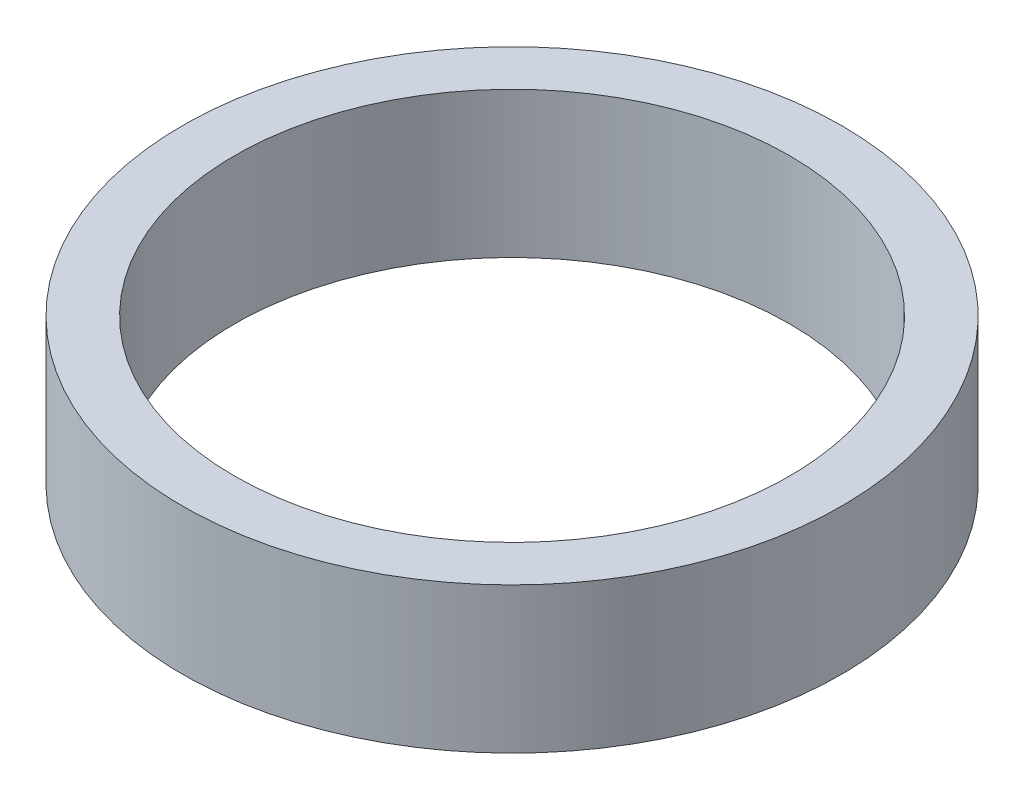
ISO-10303-21;
HEADER;
FILE_DESCRIPTION(('STEP AP214'),'2;1');
FILE_NAME('part.step','',(''),(''),'','','');
FILE_SCHEMA(('AUTOMOTIVE_DESIGN { 1 0 10303 214 1 1 1 1 }'));
ENDSEC;
DATA;
#1=APPLICATION_CONTEXT('core data for automotive mechanical design processes');
#2=APPLICATION_PROTOCOL_DEFINITION('international standard','automotive_design',2000,#1);
#3=PRODUCT_CONTEXT('',#1,'mechanical');
#4=PRODUCT('Part','Part','',(#3));
#5=PRODUCT_RELATED_PRODUCT_CATEGORY('part','',(#4));
#6=PRODUCT_DEFINITION_FORMATION('','',#4);
#7=PRODUCT_DEFINITION_CONTEXT('part definition',#1,'design');
#8=PRODUCT_DEFINITION('design','',#6,#7);
#9=PRODUCT_DEFINITION_SHAPE('','',#8);
#10=(LENGTH_UNIT() NAMED_UNIT(*) SI_UNIT(.MILLI.,.METRE.));
#11=(NAMED_UNIT(*) PLANE_ANGLE_UNIT() SI_UNIT($,.RADIAN.));
#12=(NAMED_UNIT(*) SI_UNIT($,.STERADIAN.) SOLID_ANGLE_UNIT());
#13=UNCERTAINTY_MEASURE_WITH_UNIT(LENGTH_MEASURE(1.E-05),#10,'distance_accuracy_value','');
#14=(GEOMETRIC_REPRESENTATION_CONTEXT(3) GLOBAL_UNCERTAINTY_ASSIGNED_CONTEXT((#13)) GLOBAL_UNIT_ASSIGNED_CONTEXT((#10,
#11,#12)) REPRESENTATION_CONTEXT('',''));
#15=CARTESIAN_POINT('',(0.,0.,0.));
#16=DIRECTION('',(0.,0.,1.));
#17=DIRECTION('',(1.,0.,0.));
#18=AXIS2_PLACEMENT_3D('',#15,#16,#17);
#19=CARTESIAN_POINT('',(0.,21.,0.));
#20=DIRECTION('',(0.,-1.,0.));
#21=DIRECTION('',(0.,0.,-1.));
#22=AXIS2_PLACEMENT_3D('',#19,#20,#21);
#23=CYLINDRICAL_SURFACE('',#22,47.5);
#24=CARTESIAN_POINT('',(0.,21.,0.));
#25=DIRECTION('',(0.,1.,0.));
#26=DIRECTION('',(0.,0.,1.));
#27=AXIS2_PLACEMENT_3D('',#24,#25,#26);
#28=CIRCLE('',#27,47.5);
#29=CARTESIAN_POINT('',(0.,21.,-47.5));
#30=VERTEX_POINT('',#29);
#31=EDGE_CURVE('E10',#30,#30,#28,.T.);
#32=CARTESIAN_POINT('',(0.,0.,0.));
#33=DIRECTION('',(0.,1.,0.));
#34=DIRECTION('',(0.,0.,1.));
#35=AXIS2_PLACEMENT_3D('',#32,#33,#34);
#36=CIRCLE('',#35,47.5);
#37=CARTESIAN_POINT('',(0.,0.,-47.5));
#38=VERTEX_POINT('',#37);
#39=EDGE_CURVE('E37',#38,#38,#36,.T.);
#40=CARTESIAN_POINT('',(0.,21.,-47.5));
#41=CARTESIAN_POINT('',(0.,20.78125,-47.5));
#42=CARTESIAN_POINT('',(0.,20.5625,-47.5));
#43=CARTESIAN_POINT('',(0.,20.125,-47.5));
#44=CARTESIAN_POINT('',(0.,19.90625,-47.5));
#45=CARTESIAN_POINT('',(0.,19.46875,-47.5));
#46=CARTESIAN_POINT('',(0.,19.25,-47.5));
#47=CARTESIAN_POINT('',(0.,18.8125,-47.5));
#48=CARTESIAN_POINT('',(0.,18.59375,-47.5));
#49=CARTESIAN_POINT('',(0.,18.15625,-47.5));
#50=CARTESIAN_POINT('',(0.,17.9375,-47.5));
#51=CARTESIAN_POINT('',(0.,17.5,-47.5));
#52=CARTESIAN_POINT('',(0.,17.28125,-47.5));
#53=CARTESIAN_POINT('',(0.,16.84375,-47.5));
#54=CARTESIAN_POINT('',(0.,16.625,-47.5));
#55=CARTESIAN_POINT('',(0.,16.1875,-47.5));
#56=CARTESIAN_POINT('',(0.,15.96875,-47.5));
#57=CARTESIAN_POINT('',(0.,15.53125,-47.5));
#58=CARTESIAN_POINT('',(0.,15.3125,-47.5));
#59=CARTESIAN_POINT('',(0.,14.875,-47.5));
#60=CARTESIAN_POINT('',(0.,14.65625,-47.5));
#61=CARTESIAN_POINT('',(0.,14.21875,-47.5));
#62=CARTESIAN_POINT('',(0.,14.,-47.5));
#63=CARTESIAN_POINT('',(0.,13.5625,-47.5));
#64=CARTESIAN_POINT('',(0.,13.34375,-47.5));
#65=CARTESIAN_POINT('',(0.,12.90625,-47.5));
#66=CARTESIAN_POINT('',(0.,12.6875,-47.5));
#67=CARTESIAN_POINT('',(0.,12.25,-47.5));
#68=CARTESIAN_POINT('',(0.,12.03125,-47.5));
#69=CARTESIAN_POINT('',(0.,11.59375,-47.5));
#70=CARTESIAN_POINT('',(0.,11.375,-47.5));
#71=CARTESIAN_POINT('',(0.,10.9375,-47.5));
#72=CARTESIAN_POINT('',(0.,10.71875,-47.5));
#73=CARTESIAN_POINT('',(0.,10.28125,-47.5));
#74=CARTESIAN_POINT('',(0.,10.0625,-47.5));
#75=CARTESIAN_POINT('',(0.,9.625,-47.5));
#76=CARTESIAN_POINT('',(0.,9.40625,-47.5));
#77=CARTESIAN_POINT('',(0.,8.96875,-47.5));
#78=CARTESIAN_POINT('',(0.,8.75,-47.5));
#79=CARTESIAN_POINT('',(0.,8.3125,-47.5));
#80=CARTESIAN_POINT('',(0.,8.09375,-47.5));
#81=CARTESIAN_POINT('',(0.,7.65625,-47.5));
#82=CARTESIAN_POINT('',(0.,7.4375,-47.5));
#83=CARTESIAN_POINT('',(0.,7.,-47.5));
#84=CARTESIAN_POINT('',(0.,6.78125,-47.5));
#85=CARTESIAN_POINT('',(0.,6.34375,-47.5));
#86=CARTESIAN_POINT('',(0.,6.125,-47.5));
#87=CARTESIAN_POINT('',(0.,5.6875,-47.5));
#88=CARTESIAN_POINT('',(0.,5.46875,-47.5));
#89=CARTESIAN_POINT('',(0.,5.03125,-47.5));
#90=CARTESIAN_POINT('',(0.,4.8125,-47.5));
#91=CARTESIAN_POINT('',(0.,4.375,-47.5));
#92=CARTESIAN_POINT('',(0.,4.15625,-47.5));
#93=CARTESIAN_POINT('',(0.,3.71875,-47.5));
#94=CARTESIAN_POINT('',(0.,3.5,-47.5));
#95=CARTESIAN_POINT('',(0.,3.0625,-47.5));
#96=CARTESIAN_POINT('',(0.,2.84375,-47.5));
#97=CARTESIAN_POINT('',(0.,2.40625,-47.5));
#98=CARTESIAN_POINT('',(0.,2.1875,-47.5));
#99=CARTESIAN_POINT('',(0.,1.75,-47.5));
#100=CARTESIAN_POINT('',(0.,1.53125,-47.5));
#101=CARTESIAN_POINT('',(0.,1.09375,-47.5));
#102=CARTESIAN_POINT('',(0.,0.875000000000001,-47.5));
#103=CARTESIAN_POINT('',(0.,0.4375,-47.5));
#104=CARTESIAN_POINT('',(0.,0.21875,-47.5));
#105=CARTESIAN_POINT('',(0.,0.,-47.5));
#106=B_SPLINE_CURVE_WITH_KNOTS('',3,(#40,#41,#42,#43,#44,#45,#46,#47,#48,#49,#50,#51,#52,#53,
#54,#55,#56,#57,#58,#59,#60,#61,#62,#63,#64,#65,#66,#67,#68,#69,#70,#71,#72,#73,#74,#75,#76,#77,
#78,#79,#80,#81,#82,#83,#84,#85,#86,#87,#88,#89,#90,#91,#92,#93,#94,#95,#96,#97,#98,#99,#100,
#101,#102,#103,#104,#105),.UNSPECIFIED.,.F.,.F.,(4,2,2,2,2,2,2,2,2,2,2,2,2,2,2,2,2,2,2,2,2,2,2,
2,2,2,2,2,2,2,2,2,4),(0.,0.656249999999997,1.3125,1.96875,2.625,3.28125,3.9375,4.59375,5.25,
5.90625,6.5625,7.21875,7.875,8.53125,9.1875,9.84375,10.5,11.15625,11.8125,12.46875,13.125,
13.78125,14.4375,15.09375,15.75,16.40625,17.0625,17.71875,18.375,19.03125,19.6875,20.34375,21.),.UNSPECIFIED.);
#107=EDGE_CURVE('BSEAM40',#30,#38,#106,.T.);
#108=ORIENTED_EDGE('',*,*,#31,.F.);
#109=ORIENTED_EDGE('',*,*,#39,.T.);
#110=ORIENTED_EDGE('',*,*,#107,.T.);
#111=ORIENTED_EDGE('',*,*,#107,.F.);
#112=EDGE_LOOP('',(#108,#110,#109,#111));
#113=FACE_BOUND('',#112,.T.);
#114=ADVANCED_FACE('F40',(#113),#23,.T.);
#115=CARTESIAN_POINT('',(0.,21.,0.));
#116=DIRECTION('',(0.,1.,0.));
#117=DIRECTION('',(0.,0.,1.));
#118=AXIS2_PLACEMENT_3D('',#115,#116,#117);
#119=PLANE('',#118);
#120=CARTESIAN_POINT('',(0.,21.,0.));
#121=DIRECTION('',(0.,1.,0.));
#122=DIRECTION('',(0.,0.,1.));
#123=AXIS2_PLACEMENT_3D('',#120,#121,#122);
#124=CIRCLE('',#123,40.);
#125=CARTESIAN_POINT('',(0.,21.,-40.));
#126=VERTEX_POINT('',#125);
#127=EDGE_CURVE('E50',#126,#126,#124,.T.);
#128=ORIENTED_EDGE('',*,*,#127,.F.);
#129=EDGE_LOOP('',(#128));
#130=FACE_BOUND('',#129,.T.);
#131=ORIENTED_EDGE('',*,*,#31,.T.);
#132=EDGE_LOOP('',(#131));
#133=FACE_BOUND('',#132,.T.);
#134=ADVANCED_FACE('F59',(#130,#133),#119,.T.);
#135=CARTESIAN_POINT('',(0.,0.,0.));
#136=DIRECTION('',(0.,1.,0.));
#137=DIRECTION('',(0.,0.,1.));
#138=AXIS2_PLACEMENT_3D('',#135,#136,#137);
#139=PLANE('',#138);
#140=CARTESIAN_POINT('',(0.,0.,0.));
#141=DIRECTION('',(0.,1.,0.));
#142=DIRECTION('',(0.,0.,1.));
#143=AXIS2_PLACEMENT_3D('',#140,#141,#142);
#144=CIRCLE('',#143,40.);
#145=CARTESIAN_POINT('',(0.,0.,-40.));
#146=VERTEX_POINT('',#145);
#147=EDGE_CURVE('E47',#146,#146,#144,.T.);
#148=ORIENTED_EDGE('',*,*,#147,.T.);
#149=EDGE_LOOP('',(#148));
#150=FACE_BOUND('',#149,.T.);
#151=ORIENTED_EDGE('',*,*,#39,.F.);
#152=EDGE_LOOP('',(#151));
#153=FACE_BOUND('',#152,.T.);
#154=ADVANCED_FACE('F58',(#150,#153),#139,.F.);
#155=CARTESIAN_POINT('',(0.,21.,0.));
#156=DIRECTION('',(0.,-1.,0.));
#157=DIRECTION('',(0.,0.,-1.));
#158=AXIS2_PLACEMENT_3D('',#155,#156,#157);
#159=CYLINDRICAL_SURFACE('',#158,40.);
#160=CARTESIAN_POINT('',(0.,21.,-40.));
#161=CARTESIAN_POINT('',(0.,20.78125,-40.));
#162=CARTESIAN_POINT('',(0.,20.5625,-40.));
#163=CARTESIAN_POINT('',(0.,20.125,-40.));
#164=CARTESIAN_POINT('',(0.,19.90625,-40.));
#165=CARTESIAN_POINT('',(0.,19.46875,-40.));
#166=CARTESIAN_POINT('',(0.,19.25,-40.));
#167=CARTESIAN_POINT('',(0.,18.8125,-40.));
#168=CARTESIAN_POINT('',(0.,18.59375,-40.));
#169=CARTESIAN_POINT('',(0.,18.15625,-40.));
#170=CARTESIAN_POINT('',(0.,17.9375,-40.));
#171=CARTESIAN_POINT('',(0.,17.5,-40.));
#172=CARTESIAN_POINT('',(0.,17.28125,-40.));
#173=CARTESIAN_POINT('',(0.,16.84375,-40.));
#174=CARTESIAN_POINT('',(0.,16.625,-40.));
#175=CARTESIAN_POINT('',(0.,16.1875,-40.));
#176=CARTESIAN_POINT('',(0.,15.96875,-40.));
#177=CARTESIAN_POINT('',(0.,15.53125,-40.));
#178=CARTESIAN_POINT('',(0.,15.3125,-40.));
#179=CARTESIAN_POINT('',(0.,14.875,-40.));
#180=CARTESIAN_POINT('',(0.,14.65625,-40.));
#181=CARTESIAN_POINT('',(0.,14.21875,-40.));
#182=CARTESIAN_POINT('',(0.,14.,-40.));
#183=CARTESIAN_POINT('',(0.,13.5625,-40.));
#184=CARTESIAN_POINT('',(0.,13.34375,-40.));
#185=CARTESIAN_POINT('',(0.,12.90625,-40.));
#186=CARTESIAN_POINT('',(0.,12.6875,-40.));
#187=CARTESIAN_POINT('',(0.,12.25,-40.));
#188=CARTESIAN_POINT('',(0.,12.03125,-40.));
#189=CARTESIAN_POINT('',(0.,11.59375,-40.));
#190=CARTESIAN_POINT('',(0.,11.375,-40.));
#191=CARTESIAN_POINT('',(0.,10.9375,-40.));
#192=CARTESIAN_POINT('',(0.,10.71875,-40.));
#193=CARTESIAN_POINT('',(0.,10.28125,-40.));
#194=CARTESIAN_POINT('',(0.,10.0625,-40.));
#195=CARTESIAN_POINT('',(0.,9.625,-40.));
#196=CARTESIAN_POINT('',(0.,9.40625,-40.));
#197=CARTESIAN_POINT('',(0.,8.96875,-40.));
#198=CARTESIAN_POINT('',(0.,8.75,-40.));
#199=CARTESIAN_POINT('',(0.,8.3125,-40.));
#200=CARTESIAN_POINT('',(0.,8.09375,-40.));
#201=CARTESIAN_POINT('',(0.,7.65625,-40.));
#202=CARTESIAN_POINT('',(0.,7.4375,-40.));
#203=CARTESIAN_POINT('',(0.,7.,-40.));
#204=CARTESIAN_POINT('',(0.,6.78125,-40.));
#205=CARTESIAN_POINT('',(0.,6.34375,-40.));
#206=CARTESIAN_POINT('',(0.,6.125,-40.));
#207=CARTESIAN_POINT('',(0.,5.6875,-40.));
#208=CARTESIAN_POINT('',(0.,5.46875,-40.));
#209=CARTESIAN_POINT('',(0.,5.03125,-40.));
#210=CARTESIAN_POINT('',(0.,4.8125,-40.));
#211=CARTESIAN_POINT('',(0.,4.375,-40.));
#212=CARTESIAN_POINT('',(0.,4.15625,-40.));
#213=CARTESIAN_POINT('',(0.,3.71875,-40.));
#214=CARTESIAN_POINT('',(0.,3.5,-40.));
#215=CARTESIAN_POINT('',(0.,3.0625,-40.));
#216=CARTESIAN_POINT('',(0.,2.84375,-40.));
#217=CARTESIAN_POINT('',(0.,2.40625,-40.));
#218=CARTESIAN_POINT('',(0.,2.1875,-40.));
#219=CARTESIAN_POINT('',(0.,1.75,-40.));
#220=CARTESIAN_POINT('',(0.,1.53125,-40.));
#221=CARTESIAN_POINT('',(0.,1.09375,-40.));
#222=CARTESIAN_POINT('',(0.,0.875000000000001,-40.));
#223=CARTESIAN_POINT('',(0.,0.4375,-40.));
#224=CARTESIAN_POINT('',(0.,0.21875,-40.));
#225=CARTESIAN_POINT('',(0.,0.,-40.));
#226=B_SPLINE_CURVE_WITH_KNOTS('',3,(#160,#161,#162,#163,#164,#165,#166,#167,#168,#169,#170,
#171,#172,#173,#174,#175,#176,#177,#178,#179,#180,#181,#182,#183,#184,#185,#186,#187,#188,#189,
#190,#191,#192,#193,#194,#195,#196,#197,#198,#199,#200,#201,#202,#203,#204,#205,#206,#207,#208,
#209,#210,#211,#212,#213,#214,#215,#216,#217,#218,#219,#220,#221,#222,#223,#224,#225),
.UNSPECIFIED.,.F.,.F.,(4,2,2,2,2,2,2,2,2,2,2,2,2,2,2,2,2,2,2,2,2,2,2,2,2,2,2,2,2,2,2,2,4),(0.,
0.656249999999997,1.3125,1.96875,2.625,3.28125,3.9375,4.59375,5.25,5.90625,6.5625,7.21875,7.875,
8.53125,9.1875,9.84375,10.5,11.15625,11.8125,12.46875,13.125,13.78125,14.4375,15.09375,15.75,
16.40625,17.0625,17.71875,18.375,19.03125,19.6875,20.34375,21.),.UNSPECIFIED.);
#227=EDGE_CURVE('BSEAM54',#126,#146,#226,.T.);
#228=ORIENTED_EDGE('',*,*,#127,.T.);
#229=ORIENTED_EDGE('',*,*,#147,.F.);
#230=ORIENTED_EDGE('',*,*,#227,.T.);
#231=ORIENTED_EDGE('',*,*,#227,.F.);
#232=EDGE_LOOP('',(#228,#230,#229,#231));
#233=FACE_BOUND('',#232,.T.);
#234=ADVANCED_FACE('F54',(#233),#159,.F.);
#235=CLOSED_SHELL('',(#114,#134,#154,#234));
#236=MANIFOLD_SOLID_BREP('B2',#235);
#237=ADVANCED_BREP_SHAPE_REPRESENTATION('',(#18,#236),#14);
#238=SHAPE_DEFINITION_REPRESENTATION(#9,#237);
ENDSEC;
END-ISO-10303-21;
